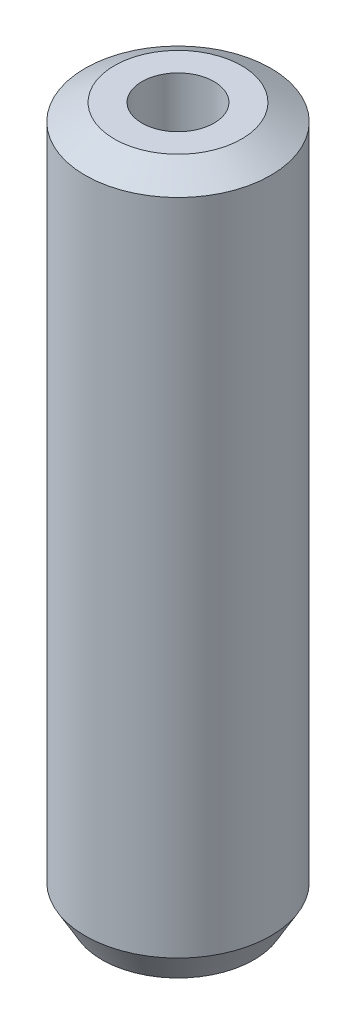
ISO-10303-21;
HEADER;
FILE_DESCRIPTION(('STEP AP214'),'2;1');
FILE_NAME('part.step','',(''),(''),'','','');
FILE_SCHEMA(('AUTOMOTIVE_DESIGN { 1 0 10303 214 1 1 1 1 }'));
ENDSEC;
DATA;
#1=APPLICATION_CONTEXT('core data for automotive mechanical design processes');
#2=APPLICATION_PROTOCOL_DEFINITION('international standard','automotive_design',2000,#1);
#3=PRODUCT_CONTEXT('',#1,'mechanical');
#4=PRODUCT('Part','Part','',(#3));
#5=PRODUCT_RELATED_PRODUCT_CATEGORY('part','',(#4));
#6=PRODUCT_DEFINITION_FORMATION('','',#4);
#7=PRODUCT_DEFINITION_CONTEXT('part definition',#1,'design');
#8=PRODUCT_DEFINITION('design','',#6,#7);
#9=PRODUCT_DEFINITION_SHAPE('','',#8);
#10=(LENGTH_UNIT() NAMED_UNIT(*) SI_UNIT(.MILLI.,.METRE.));
#11=(NAMED_UNIT(*) PLANE_ANGLE_UNIT() SI_UNIT($,.RADIAN.));
#12=(NAMED_UNIT(*) SI_UNIT($,.STERADIAN.) SOLID_ANGLE_UNIT());
#13=UNCERTAINTY_MEASURE_WITH_UNIT(LENGTH_MEASURE(1.E-05),#10,'distance_accuracy_value','');
#14=(GEOMETRIC_REPRESENTATION_CONTEXT(3) GLOBAL_UNCERTAINTY_ASSIGNED_CONTEXT((#13)) GLOBAL_UNIT_ASSIGNED_CONTEXT((#10,
#11,#12)) REPRESENTATION_CONTEXT('',''));
#15=CARTESIAN_POINT('',(0.,0.,0.));
#16=DIRECTION('',(0.,0.,1.));
#17=DIRECTION('',(1.,0.,0.));
#18=AXIS2_PLACEMENT_3D('',#15,#16,#17);
#19=CARTESIAN_POINT('',(0.,170.851390213606,0.));
#20=DIRECTION('',(0.,-1.,0.));
#21=DIRECTION('',(0.,0.,-1.));
#22=AXIS2_PLACEMENT_3D('',#19,#20,#21);
#23=CYLINDRICAL_SURFACE('',#22,22.5);
#24=CARTESIAN_POINT('',(0.,166.767014338039,0.));
#25=DIRECTION('',(0.,1.,0.));
#26=DIRECTION('',(0.,0.,1.));
#27=AXIS2_PLACEMENT_3D('',#24,#25,#26);
#28=CIRCLE('',#27,22.5);
#29=CARTESIAN_POINT('',(0.,166.767014338039,22.5));
#30=VERTEX_POINT('',#29);
#31=EDGE_CURVE('E50',#30,#30,#28,.F.);
#32=ORIENTED_EDGE('',*,*,#31,.T.);
#33=EDGE_LOOP('',(#32));
#34=FACE_BOUND('',#33,.T.);
#35=CARTESIAN_POINT('',(0.,7.07434653368996,0.));
#36=DIRECTION('',(0.,1.,0.));
#37=DIRECTION('',(0.,0.,1.));
#38=AXIS2_PLACEMENT_3D('',#35,#36,#37);
#39=CIRCLE('',#38,22.5);
#40=CARTESIAN_POINT('',(0.,7.07434653368996,22.5));
#41=VERTEX_POINT('',#40);
#42=EDGE_CURVE('E51',#41,#41,#39,.T.);
#43=ORIENTED_EDGE('',*,*,#42,.T.);
#44=EDGE_LOOP('',(#43));
#45=FACE_BOUND('',#44,.T.);
#46=ADVANCED_FACE('F39',(#34,#45),#23,.T.);
#47=CARTESIAN_POINT('',(0.,170.851390213606,0.));
#48=DIRECTION('',(0.,1.,0.));
#49=DIRECTION('',(0.,0.,1.));
#50=AXIS2_PLACEMENT_3D('',#47,#48,#49);
#51=PLANE('',#50);
#52=CARTESIAN_POINT('',(0.,170.851390213606,0.));
#53=DIRECTION('',(0.,1.,0.));
#54=DIRECTION('',(0.,0.,1.));
#55=AXIS2_PLACEMENT_3D('',#52,#53,#54);
#56=CIRCLE('',#55,15.42565346631);
#57=CARTESIAN_POINT('',(0.,170.851390213606,15.42565346631));
#58=VERTEX_POINT('',#57);
#59=EDGE_CURVE('E54',#58,#58,#56,.T.);
#60=ORIENTED_EDGE('',*,*,#59,.T.);
#61=EDGE_LOOP('',(#60));
#62=FACE_BOUND('',#61,.T.);
#63=CARTESIAN_POINT('',(0.,170.851390213606,0.));
#64=DIRECTION('',(0.,1.,0.));
#65=DIRECTION('',(0.,0.,1.));
#66=AXIS2_PLACEMENT_3D('',#63,#64,#65);
#67=CIRCLE('',#66,8.74206963466263);
#68=CARTESIAN_POINT('',(0.,170.851390213606,8.74206963466263));
#69=VERTEX_POINT('',#68);
#70=EDGE_CURVE('E58',#69,#69,#67,.T.);
#71=ORIENTED_EDGE('',*,*,#70,.F.);
#72=EDGE_LOOP('',(#71));
#73=FACE_BOUND('',#72,.T.);
#74=ADVANCED_FACE('F69',(#62,#73),#51,.T.);
#75=CARTESIAN_POINT('',(0.,0.,0.));
#76=DIRECTION('',(0.,1.,0.));
#77=DIRECTION('',(0.,0.,1.));
#78=AXIS2_PLACEMENT_3D('',#75,#76,#77);
#79=PLANE('',#78);
#80=CARTESIAN_POINT('',(0.,0.,0.));
#81=DIRECTION('',(0.,1.,0.));
#82=DIRECTION('',(0.,0.,1.));
#83=AXIS2_PLACEMENT_3D('',#80,#81,#82);
#84=CIRCLE('',#83,18.4156241244334);
#85=CARTESIAN_POINT('',(0.,0.,18.4156241244334));
#86=VERTEX_POINT('',#85);
#87=EDGE_CURVE('E10',#86,#86,#84,.F.);
#88=ORIENTED_EDGE('',*,*,#87,.T.);
#89=EDGE_LOOP('',(#88));
#90=FACE_BOUND('',#89,.T.);
#91=CARTESIAN_POINT('',(0.,0.,0.));
#92=DIRECTION('',(0.,1.,0.));
#93=DIRECTION('',(0.,0.,1.));
#94=AXIS2_PLACEMENT_3D('',#91,#92,#93);
#95=CIRCLE('',#94,8.74206963466263);
#96=CARTESIAN_POINT('',(0.,0.,8.74206963466263));
#97=VERTEX_POINT('',#96);
#98=EDGE_CURVE('E63',#97,#97,#95,.T.);
#99=ORIENTED_EDGE('',*,*,#98,.T.);
#100=EDGE_LOOP('',(#99));
#101=FACE_BOUND('',#100,.T.);
#102=ADVANCED_FACE('F75',(#90,#101),#79,.F.);
#103=CARTESIAN_POINT('',(0.,170.851390213606,0.));
#104=DIRECTION('',(0.,-1.,0.));
#105=DIRECTION('',(0.,0.,-1.));
#106=AXIS2_PLACEMENT_3D('',#103,#104,#105);
#107=CYLINDRICAL_SURFACE('',#106,8.74206963466263);
#108=ORIENTED_EDGE('',*,*,#70,.T.);
#109=EDGE_LOOP('',(#108));
#110=FACE_BOUND('',#109,.T.);
#111=ORIENTED_EDGE('',*,*,#98,.F.);
#112=EDGE_LOOP('',(#111));
#113=FACE_BOUND('',#112,.T.);
#114=ADVANCED_FACE('F70',(#110,#113),#107,.F.);
#115=CARTESIAN_POINT('',(0.,170.851390213606,0.));
#116=DIRECTION('',(0.,-1.,0.));
#117=DIRECTION('',(0.,0.,-1.));
#118=AXIS2_PLACEMENT_3D('',#115,#116,#117);
#119=CONICAL_SURFACE('',#118,15.42565346631,1.04719755119659);
#120=ORIENTED_EDGE('',*,*,#31,.F.);
#121=EDGE_LOOP('',(#120));
#122=FACE_BOUND('',#121,.T.);
#123=ORIENTED_EDGE('',*,*,#59,.F.);
#124=EDGE_LOOP('',(#123));
#125=FACE_BOUND('',#124,.T.);
#126=ADVANCED_FACE('F81',(#122,#125),#119,.T.);
#127=CARTESIAN_POINT('',(0.,7.07434653368996,0.));
#128=DIRECTION('',(0.,1.,0.));
#129=DIRECTION('',(0.,0.,1.));
#130=AXIS2_PLACEMENT_3D('',#127,#128,#129);
#131=CONICAL_SURFACE('',#130,22.5,0.523598775598304);
#132=ORIENTED_EDGE('',*,*,#87,.F.);
#133=EDGE_LOOP('',(#132));
#134=FACE_BOUND('',#133,.T.);
#135=ORIENTED_EDGE('',*,*,#42,.F.);
#136=EDGE_LOOP('',(#135));
#137=FACE_BOUND('',#136,.T.);
#138=ADVANCED_FACE('F45',(#134,#137),#131,.T.);
#139=CLOSED_SHELL('',(#46,#74,#102,#114,#126,#138));
#140=MANIFOLD_SOLID_BREP('B2',#139);
#141=ADVANCED_BREP_SHAPE_REPRESENTATION('',(#18,#140),#14);
#142=SHAPE_DEFINITION_REPRESENTATION(#9,#141);
ENDSEC;
END-ISO-10303-21;
